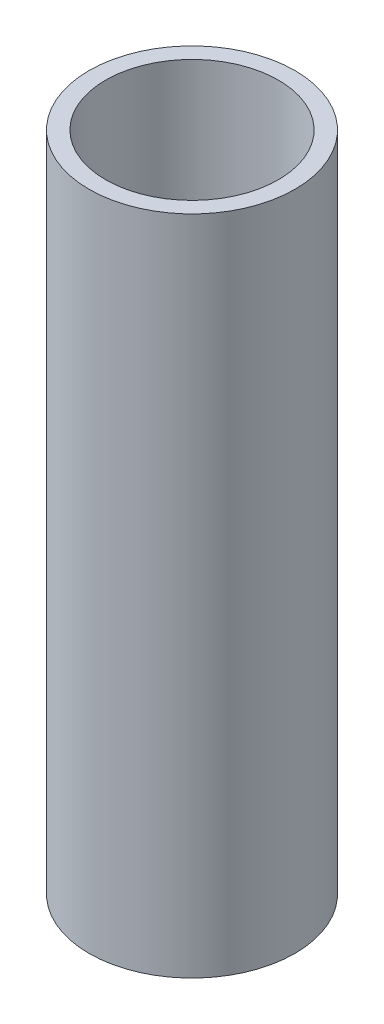
ISO-10303-21;
HEADER;
FILE_DESCRIPTION(('STEP AP214'),'2;1');
FILE_NAME('part.step','',(''),(''),'','','');
FILE_SCHEMA(('AUTOMOTIVE_DESIGN { 1 0 10303 214 1 1 1 1 }'));
ENDSEC;
DATA;
#1=APPLICATION_CONTEXT('core data for automotive mechanical design processes');
#2=APPLICATION_PROTOCOL_DEFINITION('international standard','automotive_design',2000,#1);
#3=PRODUCT_CONTEXT('',#1,'mechanical');
#4=PRODUCT('Part','Part','',(#3));
#5=PRODUCT_RELATED_PRODUCT_CATEGORY('part','',(#4));
#6=PRODUCT_DEFINITION_FORMATION('','',#4);
#7=PRODUCT_DEFINITION_CONTEXT('part definition',#1,'design');
#8=PRODUCT_DEFINITION('design','',#6,#7);
#9=PRODUCT_DEFINITION_SHAPE('','',#8);
#10=(LENGTH_UNIT() NAMED_UNIT(*) SI_UNIT(.MILLI.,.METRE.));
#11=(NAMED_UNIT(*) PLANE_ANGLE_UNIT() SI_UNIT($,.RADIAN.));
#12=(NAMED_UNIT(*) SI_UNIT($,.STERADIAN.) SOLID_ANGLE_UNIT());
#13=UNCERTAINTY_MEASURE_WITH_UNIT(LENGTH_MEASURE(1.E-05),#10,'distance_accuracy_value','');
#14=(GEOMETRIC_REPRESENTATION_CONTEXT(3) GLOBAL_UNCERTAINTY_ASSIGNED_CONTEXT((#13)) GLOBAL_UNIT_ASSIGNED_CONTEXT((#10,
#11,#12)) REPRESENTATION_CONTEXT('',''));
#15=CARTESIAN_POINT('',(0.,0.,0.));
#16=DIRECTION('',(0.,0.,1.));
#17=DIRECTION('',(1.,0.,0.));
#18=AXIS2_PLACEMENT_3D('',#15,#16,#17);
#19=CARTESIAN_POINT('',(0.,152.4,0.));
#20=DIRECTION('',(0.,-1.,0.));
#21=DIRECTION('',(0.,0.,-1.));
#22=AXIS2_PLACEMENT_3D('',#19,#20,#21);
#23=CYLINDRICAL_SURFACE('',#22,23.6982);
#24=CARTESIAN_POINT('',(0.,152.4,0.));
#25=DIRECTION('',(0.,1.,0.));
#26=DIRECTION('',(0.,0.,1.));
#27=AXIS2_PLACEMENT_3D('',#24,#25,#26);
#28=CIRCLE('',#27,23.6982);
#29=CARTESIAN_POINT('',(0.,152.4,23.6982));
#30=VERTEX_POINT('',#29);
#31=EDGE_CURVE('E10',#30,#30,#28,.T.);
#32=ORIENTED_EDGE('',*,*,#31,.F.);
#33=EDGE_LOOP('',(#32));
#34=FACE_BOUND('',#33,.T.);
#35=CARTESIAN_POINT('',(0.,0.,0.));
#36=DIRECTION('',(0.,1.,0.));
#37=DIRECTION('',(0.,0.,1.));
#38=AXIS2_PLACEMENT_3D('',#35,#36,#37);
#39=CIRCLE('',#38,23.6982);
#40=CARTESIAN_POINT('',(0.,0.,23.6982));
#41=VERTEX_POINT('',#40);
#42=EDGE_CURVE('E43',#41,#41,#39,.T.);
#43=ORIENTED_EDGE('',*,*,#42,.T.);
#44=EDGE_LOOP('',(#43));
#45=FACE_BOUND('',#44,.T.);
#46=ADVANCED_FACE('F40',(#34,#45),#23,.T.);
#47=CARTESIAN_POINT('',(0.,152.4,0.));
#48=DIRECTION('',(0.,1.,0.));
#49=DIRECTION('',(0.,0.,1.));
#50=AXIS2_PLACEMENT_3D('',#47,#48,#49);
#51=PLANE('',#50);
#52=CARTESIAN_POINT('',(0.,152.4,0.));
#53=DIRECTION('',(0.,1.,0.));
#54=DIRECTION('',(0.,0.,1.));
#55=AXIS2_PLACEMENT_3D('',#52,#53,#54);
#56=CIRCLE('',#55,19.8882);
#57=CARTESIAN_POINT('',(0.,152.4,19.8882));
#58=VERTEX_POINT('',#57);
#59=EDGE_CURVE('E57',#58,#58,#56,.T.);
#60=ORIENTED_EDGE('',*,*,#59,.F.);
#61=EDGE_LOOP('',(#60));
#62=FACE_BOUND('',#61,.T.);
#63=ORIENTED_EDGE('',*,*,#31,.T.);
#64=EDGE_LOOP('',(#63));
#65=FACE_BOUND('',#64,.T.);
#66=ADVANCED_FACE('F65',(#62,#65),#51,.T.);
#67=CARTESIAN_POINT('',(0.,0.,0.));
#68=DIRECTION('',(0.,1.,0.));
#69=DIRECTION('',(0.,0.,1.));
#70=AXIS2_PLACEMENT_3D('',#67,#68,#69);
#71=PLANE('',#70);
#72=CARTESIAN_POINT('',(0.,0.,0.));
#73=DIRECTION('',(0.,1.,0.));
#74=DIRECTION('',(0.,0.,1.));
#75=AXIS2_PLACEMENT_3D('',#72,#73,#74);
#76=CIRCLE('',#75,19.8882);
#77=CARTESIAN_POINT('',(0.,0.,19.8882));
#78=VERTEX_POINT('',#77);
#79=EDGE_CURVE('E52',#78,#78,#76,.F.);
#80=ORIENTED_EDGE('',*,*,#79,.F.);
#81=EDGE_LOOP('',(#80));
#82=FACE_BOUND('',#81,.T.);
#83=ORIENTED_EDGE('',*,*,#42,.F.);
#84=EDGE_LOOP('',(#83));
#85=FACE_BOUND('',#84,.T.);
#86=ADVANCED_FACE('F67',(#82,#85),#71,.F.);
#87=CARTESIAN_POINT('',(0.,-0.001000000000001,0.));
#88=DIRECTION('',(0.,1.,0.));
#89=DIRECTION('',(0.,0.,1.));
#90=AXIS2_PLACEMENT_3D('',#87,#88,#89);
#91=CYLINDRICAL_SURFACE('',#90,19.8882);
#92=ORIENTED_EDGE('',*,*,#59,.T.);
#93=EDGE_LOOP('',(#92));
#94=FACE_BOUND('',#93,.T.);
#95=ORIENTED_EDGE('',*,*,#79,.T.);
#96=EDGE_LOOP('',(#95));
#97=FACE_BOUND('',#96,.T.);
#98=ADVANCED_FACE('F62',(#94,#97),#91,.F.);
#99=CLOSED_SHELL('',(#46,#66,#86,#98));
#100=MANIFOLD_SOLID_BREP('B2',#99);
#101=ADVANCED_BREP_SHAPE_REPRESENTATION('',(#18,#100),#14);
#102=SHAPE_DEFINITION_REPRESENTATION(#9,#101);
ENDSEC;
END-ISO-10303-21;
